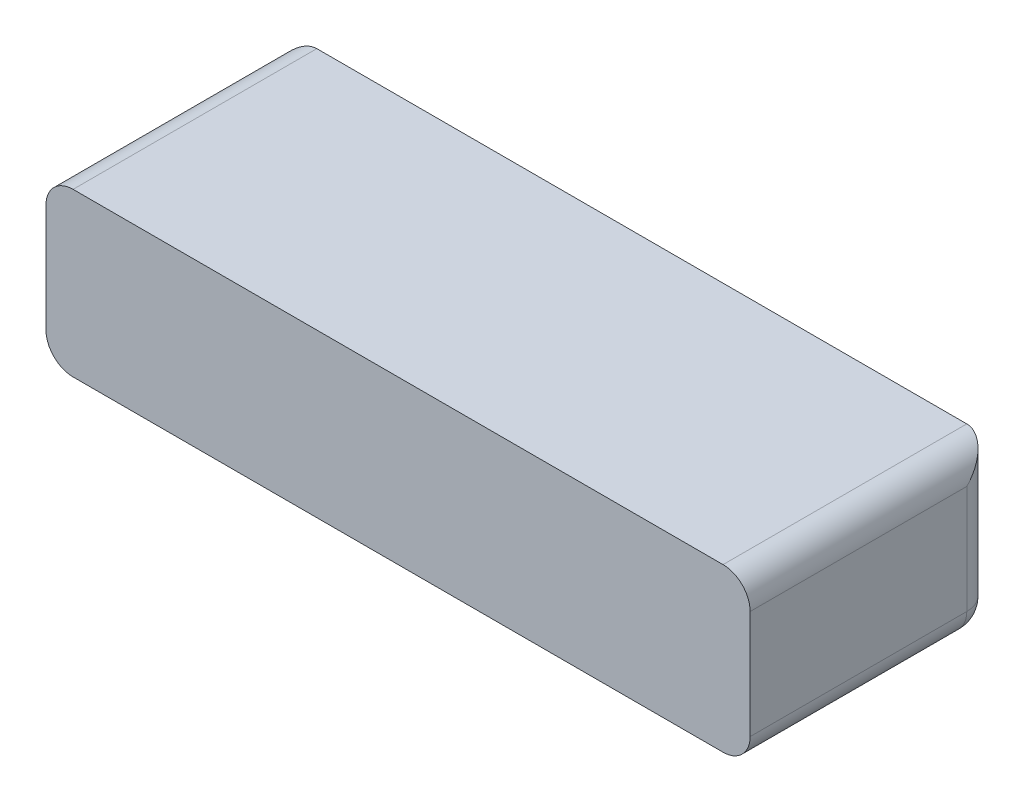
ISO-10303-21;
HEADER;
FILE_DESCRIPTION(('STEP AP214'),'2;1');
FILE_NAME('part.step','',(''),(''),'','','');
FILE_SCHEMA(('AUTOMOTIVE_DESIGN { 1 0 10303 214 1 1 1 1 }'));
ENDSEC;
DATA;
#1=APPLICATION_CONTEXT('core data for automotive mechanical design processes');
#2=APPLICATION_PROTOCOL_DEFINITION('international standard','automotive_design',2000,#1);
#3=PRODUCT_CONTEXT('',#1,'mechanical');
#4=PRODUCT('Part','Part','',(#3));
#5=PRODUCT_RELATED_PRODUCT_CATEGORY('part','',(#4));
#6=PRODUCT_DEFINITION_FORMATION('','',#4);
#7=PRODUCT_DEFINITION_CONTEXT('part definition',#1,'design');
#8=PRODUCT_DEFINITION('design','',#6,#7);
#9=PRODUCT_DEFINITION_SHAPE('','',#8);
#10=(LENGTH_UNIT() NAMED_UNIT(*) SI_UNIT(.MILLI.,.METRE.));
#11=(NAMED_UNIT(*) PLANE_ANGLE_UNIT() SI_UNIT($,.RADIAN.));
#12=(NAMED_UNIT(*) SI_UNIT($,.STERADIAN.) SOLID_ANGLE_UNIT());
#13=UNCERTAINTY_MEASURE_WITH_UNIT(LENGTH_MEASURE(1.E-05),#10,'distance_accuracy_value','');
#14=(GEOMETRIC_REPRESENTATION_CONTEXT(3) GLOBAL_UNCERTAINTY_ASSIGNED_CONTEXT((#13)) GLOBAL_UNIT_ASSIGNED_CONTEXT((#10,
#11,#12)) REPRESENTATION_CONTEXT('',''));
#15=CARTESIAN_POINT('',(0.,0.,0.));
#16=DIRECTION('',(0.,0.,1.));
#17=DIRECTION('',(1.,0.,0.));
#18=AXIS2_PLACEMENT_3D('',#15,#16,#17);
#19=CARTESIAN_POINT('',(12.,1.,-14.5));
#20=DIRECTION('',(0.577350269189625,-0.577350269189624,-0.577350269189628));
#21=DIRECTION('',(0.707106781186549,0.,0.707106781186546));
#22=AXIS2_PLACEMENT_3D('',#19,#20,#21);
#23=SPHERICAL_SURFACE('',#22,1.);
#24=CARTESIAN_POINT('',(12.5773502691896,0.422649730810376,-15.0773502691896));
#25=VERTEX_POINT('',#24);
#26=VERTEX_LOOP('',#25);
#27=FACE_BOUND('',#26,.T.);
#28=CARTESIAN_POINT('',(12.,1.,-14.5));
#29=DIRECTION('',(0.,0.,-1.));
#30=DIRECTION('',(-1.,0.,0.));
#31=AXIS2_PLACEMENT_3D('',#28,#29,#30);
#32=CIRCLE('',#31,1.);
#33=CARTESIAN_POINT('',(12.,0.,-14.5));
#34=VERTEX_POINT('',#33);
#35=CARTESIAN_POINT('',(13.,1.,-14.5));
#36=VERTEX_POINT('',#35);
#37=EDGE_CURVE('E230',#34,#36,#32,.F.);
#38=ORIENTED_EDGE('',*,*,#37,.F.);
#39=CARTESIAN_POINT('',(12.,1.,-14.5));
#40=DIRECTION('',(-1.,0.,0.));
#41=DIRECTION('',(0.,0.,1.));
#42=AXIS2_PLACEMENT_3D('',#39,#40,#41);
#43=CIRCLE('',#42,1.);
#44=CARTESIAN_POINT('',(12.,1.,-15.5));
#45=VERTEX_POINT('',#44);
#46=EDGE_CURVE('E221',#45,#34,#43,.T.);
#47=ORIENTED_EDGE('',*,*,#46,.F.);
#48=CARTESIAN_POINT('',(12.,1.,-14.5));
#49=DIRECTION('',(0.,1.,0.));
#50=DIRECTION('',(0.,0.,1.));
#51=AXIS2_PLACEMENT_3D('',#48,#49,#50);
#52=CIRCLE('',#51,1.);
#53=EDGE_CURVE('E227',#36,#45,#52,.T.);
#54=ORIENTED_EDGE('',*,*,#53,.F.);
#55=EDGE_LOOP('',(#38,#47,#54));
#56=FACE_BOUND('',#55,.T.);
#57=ADVANCED_FACE('F17',(#27,#56),#23,.T.);
#58=CARTESIAN_POINT('',(-12.,1.,-14.5));
#59=DIRECTION('',(-0.577350269189626,-0.577350269189626,-0.577350269189625));
#60=DIRECTION('',(-0.707106781186547,0.707106781186548,0.));
#61=AXIS2_PLACEMENT_3D('',#58,#59,#60);
#62=SPHERICAL_SURFACE('',#61,1.);
#63=CARTESIAN_POINT('',(-12.5773502691896,0.422649730810373,-15.0773502691896));
#64=VERTEX_POINT('',#63);
#65=VERTEX_LOOP('',#64);
#66=FACE_BOUND('',#65,.T.);
#67=CARTESIAN_POINT('',(-12.,1.,-14.5));
#68=DIRECTION('',(0.,0.,1.));
#69=DIRECTION('',(1.,0.,0.));
#70=AXIS2_PLACEMENT_3D('',#67,#68,#69);
#71=CIRCLE('',#70,1.);
#72=CARTESIAN_POINT('',(-13.,1.,-14.5));
#73=VERTEX_POINT('',#72);
#74=CARTESIAN_POINT('',(-12.,0.,-14.5));
#75=VERTEX_POINT('',#74);
#76=EDGE_CURVE('E102',#73,#75,#71,.T.);
#77=ORIENTED_EDGE('',*,*,#76,.F.);
#78=CARTESIAN_POINT('',(-12.,1.,-14.5));
#79=DIRECTION('',(0.,1.,0.));
#80=DIRECTION('',(0.,0.,1.));
#81=AXIS2_PLACEMENT_3D('',#78,#79,#80);
#82=CIRCLE('',#81,1.);
#83=CARTESIAN_POINT('',(-12.,1.,-15.5));
#84=VERTEX_POINT('',#83);
#85=EDGE_CURVE('E152',#84,#73,#82,.T.);
#86=ORIENTED_EDGE('',*,*,#85,.F.);
#87=CARTESIAN_POINT('',(-12.,1.,-14.5));
#88=DIRECTION('',(-1.,0.,0.));
#89=DIRECTION('',(0.,0.,1.));
#90=AXIS2_PLACEMENT_3D('',#87,#88,#89);
#91=CIRCLE('',#90,1.);
#92=EDGE_CURVE('E224',#75,#84,#91,.F.);
#93=ORIENTED_EDGE('',*,*,#92,.F.);
#94=EDGE_LOOP('',(#77,#86,#93));
#95=FACE_BOUND('',#94,.T.);
#96=ADVANCED_FACE('F161',(#66,#95),#62,.T.);
#97=CARTESIAN_POINT('',(-12.,1.,-13.25));
#98=DIRECTION('',(0.,0.,1.));
#99=DIRECTION('',(1.,0.,0.));
#100=AXIS2_PLACEMENT_3D('',#97,#98,#99);
#101=CYLINDRICAL_SURFACE('',#100,1.);
#102=ORIENTED_EDGE('',*,*,#76,.T.);
#103=DIRECTION('',(0.,0.,1.));
#104=VECTOR('',#103,1.);
#105=CARTESIAN_POINT('',(-12.,0.,-11.));
#106=LINE('',#105,#104);
#107=CARTESIAN_POINT('',(-12.,0.,-6.5));
#108=VERTEX_POINT('',#107);
#109=EDGE_CURVE('E100',#75,#108,#106,.T.);
#110=ORIENTED_EDGE('',*,*,#109,.T.);
#111=CARTESIAN_POINT('',(-12.,1.,-6.5));
#112=DIRECTION('',(0.,0.,1.));
#113=DIRECTION('',(1.,0.,0.));
#114=AXIS2_PLACEMENT_3D('',#111,#112,#113);
#115=CIRCLE('',#114,1.);
#116=CARTESIAN_POINT('',(-13.,1.,-6.5));
#117=VERTEX_POINT('',#116);
#118=EDGE_CURVE('E21',#108,#117,#115,.F.);
#119=ORIENTED_EDGE('',*,*,#118,.T.);
#120=DIRECTION('',(0.,0.,1.));
#121=VECTOR('',#120,1.);
#122=CARTESIAN_POINT('',(-13.,1.,-15.5));
#123=LINE('',#122,#121);
#124=EDGE_CURVE('E97',#73,#117,#123,.T.);
#125=ORIENTED_EDGE('',*,*,#124,.F.);
#126=EDGE_LOOP('',(#102,#110,#119,#125));
#127=FACE_BOUND('',#126,.T.);
#128=ADVANCED_FACE('F96',(#127),#101,.T.);
#129=CARTESIAN_POINT('',(12.,1.,-8.75));
#130=DIRECTION('',(0.,0.,-1.));
#131=DIRECTION('',(-1.,0.,0.));
#132=AXIS2_PLACEMENT_3D('',#129,#130,#131);
#133=CYLINDRICAL_SURFACE('',#132,1.);
#134=ORIENTED_EDGE('',*,*,#37,.T.);
#135=DIRECTION('',(0.,0.,-1.));
#136=VECTOR('',#135,1.);
#137=CARTESIAN_POINT('',(13.,1.,-6.5));
#138=LINE('',#137,#136);
#139=CARTESIAN_POINT('',(13.,1.,-6.5));
#140=VERTEX_POINT('',#139);
#141=EDGE_CURVE('E149',#140,#36,#138,.T.);
#142=ORIENTED_EDGE('',*,*,#141,.F.);
#143=CARTESIAN_POINT('',(12.,1.,-6.5));
#144=DIRECTION('',(0.,0.,-1.));
#145=DIRECTION('',(-1.,0.,0.));
#146=AXIS2_PLACEMENT_3D('',#143,#144,#145);
#147=CIRCLE('',#146,1.);
#148=CARTESIAN_POINT('',(12.,0.,-6.5));
#149=VERTEX_POINT('',#148);
#150=EDGE_CURVE('E233',#140,#149,#147,.T.);
#151=ORIENTED_EDGE('',*,*,#150,.T.);
#152=DIRECTION('',(0.,0.,1.));
#153=VECTOR('',#152,1.);
#154=CARTESIAN_POINT('',(12.,0.,-11.));
#155=LINE('',#154,#153);
#156=EDGE_CURVE('E144',#149,#34,#155,.F.);
#157=ORIENTED_EDGE('',*,*,#156,.T.);
#158=EDGE_LOOP('',(#134,#142,#151,#157));
#159=FACE_BOUND('',#158,.T.);
#160=ADVANCED_FACE('F167',(#159),#133,.T.);
#161=CARTESIAN_POINT('',(12.,0.,-14.5));
#162=DIRECTION('',(0.,1.,0.));
#163=DIRECTION('',(0.,0.,1.));
#164=AXIS2_PLACEMENT_3D('',#161,#162,#163);
#165=CYLINDRICAL_SURFACE('',#164,1.);
#166=DIRECTION('',(0.,1.,0.));
#167=VECTOR('',#166,1.);
#168=CARTESIAN_POINT('',(12.,0.,-15.5));
#169=LINE('',#168,#167);
#170=CARTESIAN_POINT('',(12.,6.,-15.5));
#171=VERTEX_POINT('',#170);
#172=EDGE_CURVE('E137',#171,#45,#169,.F.);
#173=ORIENTED_EDGE('',*,*,#172,.F.);
#174=CARTESIAN_POINT('',(12.,5.,-14.5));
#175=DIRECTION('',(0.,-0.707106781186547,-0.707106781186547));
#176=DIRECTION('',(0.,0.707106781186547,-0.707106781186547));
#177=AXIS2_PLACEMENT_3D('',#174,#175,#176);
#178=ELLIPSE('',#177,1.41421356237309,1.);
#179=CARTESIAN_POINT('',(13.,5.,-14.5));
#180=VERTEX_POINT('',#179);
#181=EDGE_CURVE('E140',#180,#171,#178,.F.);
#182=ORIENTED_EDGE('',*,*,#181,.F.);
#183=DIRECTION('',(0.,1.,0.));
#184=VECTOR('',#183,1.);
#185=CARTESIAN_POINT('',(13.,0.,-14.5));
#186=LINE('',#185,#184);
#187=EDGE_CURVE('E110',#36,#180,#186,.T.);
#188=ORIENTED_EDGE('',*,*,#187,.F.);
#189=ORIENTED_EDGE('',*,*,#53,.T.);
#190=EDGE_LOOP('',(#173,#182,#188,#189));
#191=FACE_BOUND('',#190,.T.);
#192=ADVANCED_FACE('F170',(#191),#165,.T.);
#193=CARTESIAN_POINT('',(6.5,1.,-14.5));
#194=DIRECTION('',(-1.,0.,0.));
#195=DIRECTION('',(0.,0.,1.));
#196=AXIS2_PLACEMENT_3D('',#193,#194,#195);
#197=CYLINDRICAL_SURFACE('',#196,1.);
#198=ORIENTED_EDGE('',*,*,#46,.T.);
#199=DIRECTION('',(1.,0.,0.));
#200=VECTOR('',#199,1.);
#201=CARTESIAN_POINT('',(0.,0.,-14.5));
#202=LINE('',#201,#200);
#203=EDGE_CURVE('E146',#34,#75,#202,.F.);
#204=ORIENTED_EDGE('',*,*,#203,.T.);
#205=ORIENTED_EDGE('',*,*,#92,.T.);
#206=DIRECTION('',(-1.,0.,0.));
#207=VECTOR('',#206,1.);
#208=CARTESIAN_POINT('',(13.,1.,-15.5));
#209=LINE('',#208,#207);
#210=EDGE_CURVE('E136',#45,#84,#209,.T.);
#211=ORIENTED_EDGE('',*,*,#210,.F.);
#212=EDGE_LOOP('',(#198,#204,#205,#211));
#213=FACE_BOUND('',#212,.T.);
#214=ADVANCED_FACE('F174',(#213),#197,.T.);
#215=CARTESIAN_POINT('',(-12.,0.,-14.5));
#216=DIRECTION('',(0.,1.,0.));
#217=DIRECTION('',(0.,0.,1.));
#218=AXIS2_PLACEMENT_3D('',#215,#216,#217);
#219=CYLINDRICAL_SURFACE('',#218,1.);
#220=DIRECTION('',(0.,1.,0.));
#221=VECTOR('',#220,1.);
#222=CARTESIAN_POINT('',(-13.,0.,-14.5));
#223=LINE('',#222,#221);
#224=CARTESIAN_POINT('',(-13.,5.,-14.5));
#225=VERTEX_POINT('',#224);
#226=EDGE_CURVE('E109',#225,#73,#223,.F.);
#227=ORIENTED_EDGE('',*,*,#226,.F.);
#228=CARTESIAN_POINT('',(-12.,5.,-14.5));
#229=DIRECTION('',(0.,0.707106781186547,0.707106781186547));
#230=DIRECTION('',(0.,-0.707106781186547,0.707106781186547));
#231=AXIS2_PLACEMENT_3D('',#228,#229,#230);
#232=ELLIPSE('',#231,1.41421356237309,1.);
#233=CARTESIAN_POINT('',(-12.,6.,-15.5));
#234=VERTEX_POINT('',#233);
#235=EDGE_CURVE('E123',#234,#225,#232,.T.);
#236=ORIENTED_EDGE('',*,*,#235,.F.);
#237=DIRECTION('',(0.,1.,0.));
#238=VECTOR('',#237,1.);
#239=CARTESIAN_POINT('',(-12.,0.,-15.5));
#240=LINE('',#239,#238);
#241=EDGE_CURVE('E131',#84,#234,#240,.T.);
#242=ORIENTED_EDGE('',*,*,#241,.F.);
#243=ORIENTED_EDGE('',*,*,#85,.T.);
#244=EDGE_LOOP('',(#227,#236,#242,#243));
#245=FACE_BOUND('',#244,.T.);
#246=ADVANCED_FACE('F178',(#245),#219,.T.);
#247=CARTESIAN_POINT('',(13.,0.,-6.5));
#248=DIRECTION('',(1.,0.,0.));
#249=DIRECTION('',(0.,0.,-1.));
#250=AXIS2_PLACEMENT_3D('',#247,#248,#249);
#251=PLANE('',#250);
#252=DIRECTION('',(0.,0.,-1.));
#253=VECTOR('',#252,1.);
#254=CARTESIAN_POINT('',(13.,5.,-8.75));
#255=LINE('',#254,#253);
#256=CARTESIAN_POINT('',(13.,5.,-6.5));
#257=VERTEX_POINT('',#256);
#258=EDGE_CURVE('E141',#257,#180,#255,.T.);
#259=ORIENTED_EDGE('',*,*,#258,.F.);
#260=DIRECTION('',(0.,1.,0.));
#261=VECTOR('',#260,1.);
#262=CARTESIAN_POINT('',(13.,0.,-6.5));
#263=LINE('',#262,#261);
#264=EDGE_CURVE('E120',#140,#257,#263,.T.);
#265=ORIENTED_EDGE('',*,*,#264,.F.);
#266=ORIENTED_EDGE('',*,*,#141,.T.);
#267=ORIENTED_EDGE('',*,*,#187,.T.);
#268=EDGE_LOOP('',(#259,#265,#266,#267));
#269=FACE_BOUND('',#268,.T.);
#270=ADVANCED_FACE('F182',(#269),#251,.T.);
#271=CARTESIAN_POINT('',(-13.,0.,-15.5));
#272=DIRECTION('',(-1.,0.,0.));
#273=DIRECTION('',(0.,0.,1.));
#274=AXIS2_PLACEMENT_3D('',#271,#272,#273);
#275=PLANE('',#274);
#276=DIRECTION('',(0.,0.,1.));
#277=VECTOR('',#276,1.);
#278=CARTESIAN_POINT('',(-13.,5.,-13.25));
#279=LINE('',#278,#277);
#280=CARTESIAN_POINT('',(-13.,5.,-6.5));
#281=VERTEX_POINT('',#280);
#282=EDGE_CURVE('E129',#225,#281,#279,.T.);
#283=ORIENTED_EDGE('',*,*,#282,.F.);
#284=ORIENTED_EDGE('',*,*,#226,.T.);
#285=ORIENTED_EDGE('',*,*,#124,.T.);
#286=DIRECTION('',(0.,1.,0.));
#287=VECTOR('',#286,1.);
#288=CARTESIAN_POINT('',(-13.,0.,-6.5));
#289=LINE('',#288,#287);
#290=EDGE_CURVE('E108',#281,#117,#289,.F.);
#291=ORIENTED_EDGE('',*,*,#290,.F.);
#292=EDGE_LOOP('',(#283,#284,#285,#291));
#293=FACE_BOUND('',#292,.T.);
#294=ADVANCED_FACE('F107',(#293),#275,.T.);
#295=CARTESIAN_POINT('',(0.,0.,-11.));
#296=DIRECTION('',(0.,1.,0.));
#297=DIRECTION('',(0.,0.,1.));
#298=AXIS2_PLACEMENT_3D('',#295,#296,#297);
#299=PLANE('',#298);
#300=DIRECTION('',(1.,0.,0.));
#301=VECTOR('',#300,1.);
#302=CARTESIAN_POINT('',(-13.,0.,-6.5));
#303=LINE('',#302,#301);
#304=EDGE_CURVE('E113',#108,#149,#303,.T.);
#305=ORIENTED_EDGE('',*,*,#304,.F.);
#306=ORIENTED_EDGE('',*,*,#109,.F.);
#307=ORIENTED_EDGE('',*,*,#203,.F.);
#308=ORIENTED_EDGE('',*,*,#156,.F.);
#309=EDGE_LOOP('',(#305,#306,#307,#308));
#310=FACE_BOUND('',#309,.T.);
#311=ADVANCED_FACE('F189',(#310),#299,.F.);
#312=CARTESIAN_POINT('',(12.,5.,-8.75));
#313=DIRECTION('',(0.,0.,-1.));
#314=DIRECTION('',(-1.,0.,0.));
#315=AXIS2_PLACEMENT_3D('',#312,#313,#314);
#316=CYLINDRICAL_SURFACE('',#315,1.);
#317=ORIENTED_EDGE('',*,*,#258,.T.);
#318=ORIENTED_EDGE('',*,*,#181,.T.);
#319=DIRECTION('',(0.,0.,1.));
#320=VECTOR('',#319,1.);
#321=CARTESIAN_POINT('',(12.,6.,-11.));
#322=LINE('',#321,#320);
#323=CARTESIAN_POINT('',(12.,6.,-6.5));
#324=VERTEX_POINT('',#323);
#325=EDGE_CURVE('E115',#324,#171,#322,.F.);
#326=ORIENTED_EDGE('',*,*,#325,.F.);
#327=CARTESIAN_POINT('',(12.,5.,-6.5));
#328=DIRECTION('',(0.,0.,-1.));
#329=DIRECTION('',(-1.,0.,0.));
#330=AXIS2_PLACEMENT_3D('',#327,#328,#329);
#331=CIRCLE('',#330,1.);
#332=EDGE_CURVE('E117',#257,#324,#331,.F.);
#333=ORIENTED_EDGE('',*,*,#332,.F.);
#334=EDGE_LOOP('',(#317,#318,#326,#333));
#335=FACE_BOUND('',#334,.T.);
#336=ADVANCED_FACE('F192',(#335),#316,.T.);
#337=CARTESIAN_POINT('',(13.,0.,-15.5));
#338=DIRECTION('',(0.,0.,-1.));
#339=DIRECTION('',(-1.,0.,0.));
#340=AXIS2_PLACEMENT_3D('',#337,#338,#339);
#341=PLANE('',#340);
#342=ORIENTED_EDGE('',*,*,#241,.T.);
#343=DIRECTION('',(1.,0.,0.));
#344=VECTOR('',#343,1.);
#345=CARTESIAN_POINT('',(0.,6.,-15.5));
#346=LINE('',#345,#344);
#347=EDGE_CURVE('E125',#171,#234,#346,.F.);
#348=ORIENTED_EDGE('',*,*,#347,.F.);
#349=ORIENTED_EDGE('',*,*,#172,.T.);
#350=ORIENTED_EDGE('',*,*,#210,.T.);
#351=EDGE_LOOP('',(#342,#348,#349,#350));
#352=FACE_BOUND('',#351,.T.);
#353=ADVANCED_FACE('F196',(#352),#341,.T.);
#354=CARTESIAN_POINT('',(-12.,5.,-13.25));
#355=DIRECTION('',(0.,0.,1.));
#356=DIRECTION('',(1.,0.,0.));
#357=AXIS2_PLACEMENT_3D('',#354,#355,#356);
#358=CYLINDRICAL_SURFACE('',#357,1.);
#359=DIRECTION('',(0.,0.,1.));
#360=VECTOR('',#359,1.);
#361=CARTESIAN_POINT('',(-12.,6.,-11.));
#362=LINE('',#361,#360);
#363=CARTESIAN_POINT('',(-12.,6.,-6.5));
#364=VERTEX_POINT('',#363);
#365=EDGE_CURVE('E27',#234,#364,#362,.T.);
#366=ORIENTED_EDGE('',*,*,#365,.F.);
#367=ORIENTED_EDGE('',*,*,#235,.T.);
#368=ORIENTED_EDGE('',*,*,#282,.T.);
#369=CARTESIAN_POINT('',(-12.,5.,-6.5));
#370=DIRECTION('',(0.,0.,1.));
#371=DIRECTION('',(1.,0.,0.));
#372=AXIS2_PLACEMENT_3D('',#369,#370,#371);
#373=CIRCLE('',#372,1.);
#374=EDGE_CURVE('E36',#364,#281,#373,.T.);
#375=ORIENTED_EDGE('',*,*,#374,.F.);
#376=EDGE_LOOP('',(#366,#367,#368,#375));
#377=FACE_BOUND('',#376,.T.);
#378=ADVANCED_FACE('F200',(#377),#358,.T.);
#379=CARTESIAN_POINT('',(-13.,0.,-6.5));
#380=DIRECTION('',(0.,0.,1.));
#381=DIRECTION('',(1.,0.,0.));
#382=AXIS2_PLACEMENT_3D('',#379,#380,#381);
#383=PLANE('',#382);
#384=ORIENTED_EDGE('',*,*,#118,.F.);
#385=ORIENTED_EDGE('',*,*,#304,.T.);
#386=ORIENTED_EDGE('',*,*,#150,.F.);
#387=ORIENTED_EDGE('',*,*,#264,.T.);
#388=ORIENTED_EDGE('',*,*,#332,.T.);
#389=DIRECTION('',(1.,0.,0.));
#390=VECTOR('',#389,1.);
#391=CARTESIAN_POINT('',(0.,6.,-6.5));
#392=LINE('',#391,#390);
#393=EDGE_CURVE('E11',#364,#324,#392,.T.);
#394=ORIENTED_EDGE('',*,*,#393,.F.);
#395=ORIENTED_EDGE('',*,*,#374,.T.);
#396=ORIENTED_EDGE('',*,*,#290,.T.);
#397=EDGE_LOOP('',(#384,#385,#386,#387,#388,#394,#395,#396));
#398=FACE_BOUND('',#397,.T.);
#399=ADVANCED_FACE('F112',(#398),#383,.T.);
#400=CARTESIAN_POINT('',(0.,6.,-11.));
#401=DIRECTION('',(0.,1.,0.));
#402=DIRECTION('',(0.,0.,1.));
#403=AXIS2_PLACEMENT_3D('',#400,#401,#402);
#404=PLANE('',#403);
#405=ORIENTED_EDGE('',*,*,#365,.T.);
#406=ORIENTED_EDGE('',*,*,#393,.T.);
#407=ORIENTED_EDGE('',*,*,#325,.T.);
#408=ORIENTED_EDGE('',*,*,#347,.T.);
#409=EDGE_LOOP('',(#405,#406,#407,#408));
#410=FACE_BOUND('',#409,.T.);
#411=ADVANCED_FACE('F206',(#410),#404,.T.);
#412=CLOSED_SHELL('',(#57,#96,#128,#160,#192,#214,#246,#270,#294,#311,#336,#353,#378,#399,#411));
#413=MANIFOLD_SOLID_BREP('B1',#412);
#414=ADVANCED_BREP_SHAPE_REPRESENTATION('',(#18,#413),#14);
#415=SHAPE_DEFINITION_REPRESENTATION(#9,#414);
ENDSEC;
END-ISO-10303-21;
